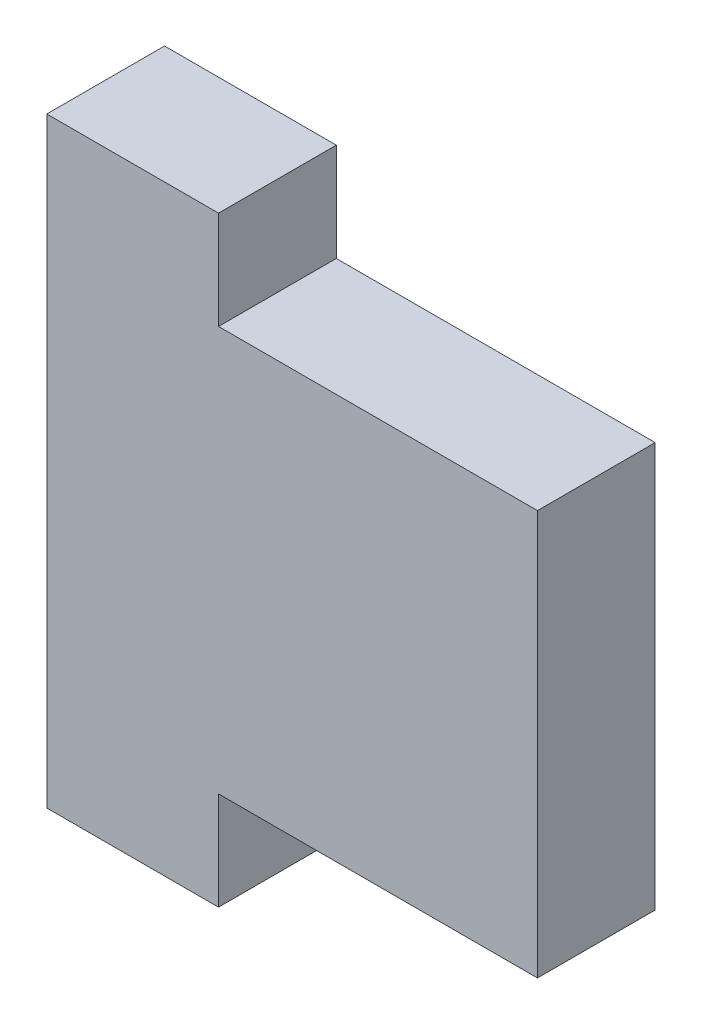
ISO-10303-21;
HEADER;
FILE_DESCRIPTION(('STEP AP214'),'2;1');
FILE_NAME('part.step','',(''),(''),'','','');
FILE_SCHEMA(('AUTOMOTIVE_DESIGN { 1 0 10303 214 1 1 1 1 }'));
ENDSEC;
DATA;
#1=APPLICATION_CONTEXT('core data for automotive mechanical design processes');
#2=APPLICATION_PROTOCOL_DEFINITION('international standard','automotive_design',2000,#1);
#3=PRODUCT_CONTEXT('',#1,'mechanical');
#4=PRODUCT('Part','Part','',(#3));
#5=PRODUCT_RELATED_PRODUCT_CATEGORY('part','',(#4));
#6=PRODUCT_DEFINITION_FORMATION('','',#4);
#7=PRODUCT_DEFINITION_CONTEXT('part definition',#1,'design');
#8=PRODUCT_DEFINITION('design','',#6,#7);
#9=PRODUCT_DEFINITION_SHAPE('','',#8);
#10=(LENGTH_UNIT() NAMED_UNIT(*) SI_UNIT(.MILLI.,.METRE.));
#11=(NAMED_UNIT(*) PLANE_ANGLE_UNIT() SI_UNIT($,.RADIAN.));
#12=(NAMED_UNIT(*) SI_UNIT($,.STERADIAN.) SOLID_ANGLE_UNIT());
#13=UNCERTAINTY_MEASURE_WITH_UNIT(LENGTH_MEASURE(1.E-05),#10,'distance_accuracy_value','');
#14=(GEOMETRIC_REPRESENTATION_CONTEXT(3) GLOBAL_UNCERTAINTY_ASSIGNED_CONTEXT((#13)) GLOBAL_UNIT_ASSIGNED_CONTEXT((#10,
#11,#12)) REPRESENTATION_CONTEXT('',''));
#15=CARTESIAN_POINT('',(0.,0.,0.));
#16=DIRECTION('',(0.,0.,1.));
#17=DIRECTION('',(1.,0.,0.));
#18=AXIS2_PLACEMENT_3D('',#15,#16,#17);
#19=CARTESIAN_POINT('',(-55.626,10.4775,3.048));
#20=DIRECTION('',(-1.,0.,0.));
#21=DIRECTION('',(0.,0.,1.));
#22=AXIS2_PLACEMENT_3D('',#19,#20,#21);
#23=PLANE('',#22);
#24=DIRECTION('',(0.,1.,0.));
#25=VECTOR('',#24,1.);
#26=CARTESIAN_POINT('',(-55.626,10.4775,-3.048));
#27=LINE('',#26,#25);
#28=CARTESIAN_POINT('',(-55.626,-10.4775,-3.048));
#29=VERTEX_POINT('',#28);
#30=CARTESIAN_POINT('',(-55.626,10.4775,-3.048));
#31=VERTEX_POINT('',#30);
#32=EDGE_CURVE('E129',#29,#31,#27,.T.);
#33=ORIENTED_EDGE('',*,*,#32,.T.);
#34=DIRECTION('',(0.,0.,-1.));
#35=VECTOR('',#34,1.);
#36=CARTESIAN_POINT('',(-55.626,10.4775,3.048));
#37=LINE('',#36,#35);
#38=CARTESIAN_POINT('',(-55.626,10.4775,3.048));
#39=VERTEX_POINT('',#38);
#40=EDGE_CURVE('E11',#39,#31,#37,.T.);
#41=ORIENTED_EDGE('',*,*,#40,.F.);
#42=DIRECTION('',(0.,1.,0.));
#43=VECTOR('',#42,1.);
#44=CARTESIAN_POINT('',(-55.626,10.4775,3.048));
#45=LINE('',#44,#43);
#46=CARTESIAN_POINT('',(-55.626,-10.4775,3.048));
#47=VERTEX_POINT('',#46);
#48=EDGE_CURVE('E143',#47,#39,#45,.T.);
#49=ORIENTED_EDGE('',*,*,#48,.F.);
#50=DIRECTION('',(0.,0.,-1.));
#51=VECTOR('',#50,1.);
#52=CARTESIAN_POINT('',(-55.626,-10.4775,3.048));
#53=LINE('',#52,#51);
#54=EDGE_CURVE('E125',#47,#29,#53,.T.);
#55=ORIENTED_EDGE('',*,*,#54,.T.);
#56=EDGE_LOOP('',(#33,#41,#49,#55));
#57=FACE_BOUND('',#56,.T.);
#58=ADVANCED_FACE('F33',(#57),#23,.F.);
#59=CARTESIAN_POINT('',(-55.626,10.4775,3.048));
#60=DIRECTION('',(0.,-1.,0.));
#61=DIRECTION('',(0.,0.,-1.));
#62=AXIS2_PLACEMENT_3D('',#59,#60,#61);
#63=PLANE('',#62);
#64=DIRECTION('',(-1.,0.,0.));
#65=VECTOR('',#64,1.);
#66=CARTESIAN_POINT('',(-55.626,10.4775,-3.048));
#67=LINE('',#66,#65);
#68=CARTESIAN_POINT('',(-72.136,10.4775,-3.048));
#69=VERTEX_POINT('',#68);
#70=EDGE_CURVE('E132',#31,#69,#67,.T.);
#71=ORIENTED_EDGE('',*,*,#70,.T.);
#72=DIRECTION('',(0.,0.,-1.));
#73=VECTOR('',#72,1.);
#74=CARTESIAN_POINT('',(-72.136,10.4775,3.048));
#75=LINE('',#74,#73);
#76=CARTESIAN_POINT('',(-72.136,10.4775,3.048));
#77=VERTEX_POINT('',#76);
#78=EDGE_CURVE('E41',#77,#69,#75,.T.);
#79=ORIENTED_EDGE('',*,*,#78,.F.);
#80=DIRECTION('',(-1.,0.,0.));
#81=VECTOR('',#80,1.);
#82=CARTESIAN_POINT('',(-55.626,10.4775,3.048));
#83=LINE('',#82,#81);
#84=EDGE_CURVE('E92',#39,#77,#83,.T.);
#85=ORIENTED_EDGE('',*,*,#84,.F.);
#86=ORIENTED_EDGE('',*,*,#40,.T.);
#87=EDGE_LOOP('',(#71,#79,#85,#86));
#88=FACE_BOUND('',#87,.T.);
#89=ADVANCED_FACE('F178',(#88),#63,.F.);
#90=CARTESIAN_POINT('',(-72.136,15.5575,3.048));
#91=DIRECTION('',(-1.,0.,0.));
#92=DIRECTION('',(0.,0.,1.));
#93=AXIS2_PLACEMENT_3D('',#90,#91,#92);
#94=PLANE('',#93);
#95=DIRECTION('',(0.,1.,0.));
#96=VECTOR('',#95,1.);
#97=CARTESIAN_POINT('',(-72.136,15.5575,-3.048));
#98=LINE('',#97,#96);
#99=CARTESIAN_POINT('',(-72.136,15.5575,-3.048));
#100=VERTEX_POINT('',#99);
#101=EDGE_CURVE('E134',#69,#100,#98,.T.);
#102=ORIENTED_EDGE('',*,*,#101,.T.);
#103=DIRECTION('',(0.,0.,-1.));
#104=VECTOR('',#103,1.);
#105=CARTESIAN_POINT('',(-72.136,15.5575,3.048));
#106=LINE('',#105,#104);
#107=CARTESIAN_POINT('',(-72.136,15.5575,3.048));
#108=VERTEX_POINT('',#107);
#109=EDGE_CURVE('E150',#108,#100,#106,.T.);
#110=ORIENTED_EDGE('',*,*,#109,.F.);
#111=DIRECTION('',(0.,1.,0.));
#112=VECTOR('',#111,1.);
#113=CARTESIAN_POINT('',(-72.136,15.5575,3.048));
#114=LINE('',#113,#112);
#115=EDGE_CURVE('E158',#77,#108,#114,.T.);
#116=ORIENTED_EDGE('',*,*,#115,.F.);
#117=ORIENTED_EDGE('',*,*,#78,.T.);
#118=EDGE_LOOP('',(#102,#110,#116,#117));
#119=FACE_BOUND('',#118,.T.);
#120=ADVANCED_FACE('F156',(#119),#94,.F.);
#121=CARTESIAN_POINT('',(-72.136,15.5575,3.048));
#122=DIRECTION('',(0.,-1.,0.));
#123=DIRECTION('',(1.,0.,0.));
#124=AXIS2_PLACEMENT_3D('',#121,#122,#123);
#125=PLANE('',#124);
#126=DIRECTION('',(-1.,0.,0.));
#127=VECTOR('',#126,1.);
#128=CARTESIAN_POINT('',(-72.136,15.5575,-3.048));
#129=LINE('',#128,#127);
#130=CARTESIAN_POINT('',(-81.026,15.5575,-3.048));
#131=VERTEX_POINT('',#130);
#132=EDGE_CURVE('E136',#100,#131,#129,.T.);
#133=ORIENTED_EDGE('',*,*,#132,.T.);
#134=DIRECTION('',(0.,0.,-1.));
#135=VECTOR('',#134,1.);
#136=CARTESIAN_POINT('',(-81.026,15.5575,3.048));
#137=LINE('',#136,#135);
#138=CARTESIAN_POINT('',(-81.026,15.5575,3.048));
#139=VERTEX_POINT('',#138);
#140=EDGE_CURVE('E147',#139,#131,#137,.T.);
#141=ORIENTED_EDGE('',*,*,#140,.F.);
#142=DIRECTION('',(-1.,0.,0.));
#143=VECTOR('',#142,1.);
#144=CARTESIAN_POINT('',(-72.136,15.5575,3.048));
#145=LINE('',#144,#143);
#146=EDGE_CURVE('E170',#108,#139,#145,.T.);
#147=ORIENTED_EDGE('',*,*,#146,.F.);
#148=ORIENTED_EDGE('',*,*,#109,.T.);
#149=EDGE_LOOP('',(#133,#141,#147,#148));
#150=FACE_BOUND('',#149,.T.);
#151=ADVANCED_FACE('F166',(#150),#125,.F.);
#152=CARTESIAN_POINT('',(-81.026,15.5575,3.048));
#153=DIRECTION('',(1.,0.,0.));
#154=DIRECTION('',(0.,0.,-1.));
#155=AXIS2_PLACEMENT_3D('',#152,#153,#154);
#156=PLANE('',#155);
#157=DIRECTION('',(0.,-1.,0.));
#158=VECTOR('',#157,1.);
#159=CARTESIAN_POINT('',(-81.026,15.5575,-3.048));
#160=LINE('',#159,#158);
#161=CARTESIAN_POINT('',(-81.026,-15.5575,-3.048));
#162=VERTEX_POINT('',#161);
#163=EDGE_CURVE('E138',#131,#162,#160,.T.);
#164=ORIENTED_EDGE('',*,*,#163,.T.);
#165=DIRECTION('',(0.,0.,-1.));
#166=VECTOR('',#165,1.);
#167=CARTESIAN_POINT('',(-81.026,-15.5575,3.048));
#168=LINE('',#167,#166);
#169=CARTESIAN_POINT('',(-81.026,-15.5575,3.048));
#170=VERTEX_POINT('',#169);
#171=EDGE_CURVE('E120',#170,#162,#168,.T.);
#172=ORIENTED_EDGE('',*,*,#171,.F.);
#173=DIRECTION('',(0.,-1.,0.));
#174=VECTOR('',#173,1.);
#175=CARTESIAN_POINT('',(-81.026,15.5575,3.048));
#176=LINE('',#175,#174);
#177=EDGE_CURVE('E111',#139,#170,#176,.T.);
#178=ORIENTED_EDGE('',*,*,#177,.F.);
#179=ORIENTED_EDGE('',*,*,#140,.T.);
#180=EDGE_LOOP('',(#164,#172,#178,#179));
#181=FACE_BOUND('',#180,.T.);
#182=ADVANCED_FACE('F169',(#181),#156,.F.);
#183=CARTESIAN_POINT('',(-72.136,-15.5575,3.048));
#184=DIRECTION('',(0.,1.,0.));
#185=DIRECTION('',(-1.,0.,0.));
#186=AXIS2_PLACEMENT_3D('',#183,#184,#185);
#187=PLANE('',#186);
#188=DIRECTION('',(1.,0.,0.));
#189=VECTOR('',#188,1.);
#190=CARTESIAN_POINT('',(-72.136,-15.5575,-3.048));
#191=LINE('',#190,#189);
#192=CARTESIAN_POINT('',(-72.136,-15.5575,-3.048));
#193=VERTEX_POINT('',#192);
#194=EDGE_CURVE('E119',#162,#193,#191,.T.);
#195=ORIENTED_EDGE('',*,*,#194,.T.);
#196=DIRECTION('',(0.,0.,-1.));
#197=VECTOR('',#196,1.);
#198=CARTESIAN_POINT('',(-72.136,-15.5575,3.048));
#199=LINE('',#198,#197);
#200=CARTESIAN_POINT('',(-72.136,-15.5575,3.048));
#201=VERTEX_POINT('',#200);
#202=EDGE_CURVE('E116',#201,#193,#199,.T.);
#203=ORIENTED_EDGE('',*,*,#202,.F.);
#204=DIRECTION('',(1.,0.,0.));
#205=VECTOR('',#204,1.);
#206=CARTESIAN_POINT('',(-72.136,-15.5575,3.048));
#207=LINE('',#206,#205);
#208=EDGE_CURVE('E105',#170,#201,#207,.T.);
#209=ORIENTED_EDGE('',*,*,#208,.F.);
#210=ORIENTED_EDGE('',*,*,#171,.T.);
#211=EDGE_LOOP('',(#195,#203,#209,#210));
#212=FACE_BOUND('',#211,.T.);
#213=ADVANCED_FACE('F117',(#212),#187,.F.);
#214=CARTESIAN_POINT('',(-72.136,-10.4775,3.048));
#215=DIRECTION('',(-1.,0.,0.));
#216=DIRECTION('',(0.,0.,1.));
#217=AXIS2_PLACEMENT_3D('',#214,#215,#216);
#218=PLANE('',#217);
#219=DIRECTION('',(0.,1.,0.));
#220=VECTOR('',#219,1.);
#221=CARTESIAN_POINT('',(-72.136,-10.4775,-3.048));
#222=LINE('',#221,#220);
#223=CARTESIAN_POINT('',(-72.136,-10.4775,-3.048));
#224=VERTEX_POINT('',#223);
#225=EDGE_CURVE('E78',#193,#224,#222,.T.);
#226=ORIENTED_EDGE('',*,*,#225,.T.);
#227=DIRECTION('',(0.,0.,-1.));
#228=VECTOR('',#227,1.);
#229=CARTESIAN_POINT('',(-72.136,-10.4775,3.048));
#230=LINE('',#229,#228);
#231=CARTESIAN_POINT('',(-72.136,-10.4775,3.048));
#232=VERTEX_POINT('',#231);
#233=EDGE_CURVE('E121',#232,#224,#230,.T.);
#234=ORIENTED_EDGE('',*,*,#233,.F.);
#235=DIRECTION('',(0.,1.,0.));
#236=VECTOR('',#235,1.);
#237=CARTESIAN_POINT('',(-72.136,-10.4775,3.048));
#238=LINE('',#237,#236);
#239=EDGE_CURVE('E109',#201,#232,#238,.T.);
#240=ORIENTED_EDGE('',*,*,#239,.F.);
#241=ORIENTED_EDGE('',*,*,#202,.T.);
#242=EDGE_LOOP('',(#226,#234,#240,#241));
#243=FACE_BOUND('',#242,.T.);
#244=ADVANCED_FACE('F123',(#243),#218,.F.);
#245=CARTESIAN_POINT('',(-55.626,-10.4775,3.048));
#246=DIRECTION('',(0.,1.,0.));
#247=DIRECTION('',(-1.,0.,0.));
#248=AXIS2_PLACEMENT_3D('',#245,#246,#247);
#249=PLANE('',#248);
#250=DIRECTION('',(1.,0.,0.));
#251=VECTOR('',#250,1.);
#252=CARTESIAN_POINT('',(-55.626,-10.4775,-3.048));
#253=LINE('',#252,#251);
#254=EDGE_CURVE('E84',#224,#29,#253,.T.);
#255=ORIENTED_EDGE('',*,*,#254,.T.);
#256=ORIENTED_EDGE('',*,*,#54,.F.);
#257=DIRECTION('',(1.,0.,0.));
#258=VECTOR('',#257,1.);
#259=CARTESIAN_POINT('',(-55.626,-10.4775,3.048));
#260=LINE('',#259,#258);
#261=EDGE_CURVE('E49',#232,#47,#260,.T.);
#262=ORIENTED_EDGE('',*,*,#261,.F.);
#263=ORIENTED_EDGE('',*,*,#233,.T.);
#264=EDGE_LOOP('',(#255,#256,#262,#263));
#265=FACE_BOUND('',#264,.T.);
#266=ADVANCED_FACE('F194',(#265),#249,.F.);
#267=CARTESIAN_POINT('',(0.,0.,3.048));
#268=DIRECTION('',(0.,0.,-1.));
#269=DIRECTION('',(-1.,0.,0.));
#270=AXIS2_PLACEMENT_3D('',#267,#268,#269);
#271=PLANE('',#270);
#272=ORIENTED_EDGE('',*,*,#48,.T.);
#273=ORIENTED_EDGE('',*,*,#84,.T.);
#274=ORIENTED_EDGE('',*,*,#115,.T.);
#275=ORIENTED_EDGE('',*,*,#146,.T.);
#276=ORIENTED_EDGE('',*,*,#177,.T.);
#277=ORIENTED_EDGE('',*,*,#208,.T.);
#278=ORIENTED_EDGE('',*,*,#239,.T.);
#279=ORIENTED_EDGE('',*,*,#261,.T.);
#280=EDGE_LOOP('',(#272,#273,#274,#275,#276,#277,#278,#279));
#281=FACE_BOUND('',#280,.T.);
#282=ADVANCED_FACE('F107',(#281),#271,.F.);
#283=CARTESIAN_POINT('',(0.,0.,-3.048));
#284=DIRECTION('',(0.,0.,-1.));
#285=DIRECTION('',(-1.,0.,0.));
#286=AXIS2_PLACEMENT_3D('',#283,#284,#285);
#287=PLANE('',#286);
#288=ORIENTED_EDGE('',*,*,#32,.F.);
#289=ORIENTED_EDGE('',*,*,#254,.F.);
#290=ORIENTED_EDGE('',*,*,#225,.F.);
#291=ORIENTED_EDGE('',*,*,#194,.F.);
#292=ORIENTED_EDGE('',*,*,#163,.F.);
#293=ORIENTED_EDGE('',*,*,#132,.F.);
#294=ORIENTED_EDGE('',*,*,#101,.F.);
#295=ORIENTED_EDGE('',*,*,#70,.F.);
#296=EDGE_LOOP('',(#288,#289,#290,#291,#292,#293,#294,#295));
#297=FACE_BOUND('',#296,.T.);
#298=ADVANCED_FACE('F162',(#297),#287,.T.);
#299=CLOSED_SHELL('',(#58,#89,#120,#151,#182,#213,#244,#266,#282,#298));
#300=MANIFOLD_SOLID_BREP('B2',#299);
#301=ADVANCED_BREP_SHAPE_REPRESENTATION('',(#18,#300),#14);
#302=SHAPE_DEFINITION_REPRESENTATION(#9,#301);
ENDSEC;
END-ISO-10303-21;
